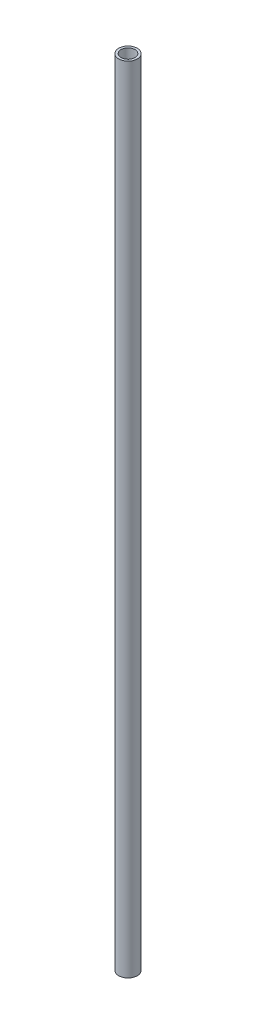
ISO-10303-21;
HEADER;
FILE_DESCRIPTION(('STEP AP214'),'2;1');
FILE_NAME('part.step','',(''),(''),'','','');
FILE_SCHEMA(('AUTOMOTIVE_DESIGN { 1 0 10303 214 1 1 1 1 }'));
ENDSEC;
DATA;
#1=APPLICATION_CONTEXT('core data for automotive mechanical design processes');
#2=APPLICATION_PROTOCOL_DEFINITION('international standard','automotive_design',2000,#1);
#3=PRODUCT_CONTEXT('',#1,'mechanical');
#4=PRODUCT('Part','Part','',(#3));
#5=PRODUCT_RELATED_PRODUCT_CATEGORY('part','',(#4));
#6=PRODUCT_DEFINITION_FORMATION('','',#4);
#7=PRODUCT_DEFINITION_CONTEXT('part definition',#1,'design');
#8=PRODUCT_DEFINITION('design','',#6,#7);
#9=PRODUCT_DEFINITION_SHAPE('','',#8);
#10=(LENGTH_UNIT() NAMED_UNIT(*) SI_UNIT(.MILLI.,.METRE.));
#11=(NAMED_UNIT(*) PLANE_ANGLE_UNIT() SI_UNIT($,.RADIAN.));
#12=(NAMED_UNIT(*) SI_UNIT($,.STERADIAN.) SOLID_ANGLE_UNIT());
#13=UNCERTAINTY_MEASURE_WITH_UNIT(LENGTH_MEASURE(1.E-05),#10,'distance_accuracy_value','');
#14=(GEOMETRIC_REPRESENTATION_CONTEXT(3) GLOBAL_UNCERTAINTY_ASSIGNED_CONTEXT((#13)) GLOBAL_UNIT_ASSIGNED_CONTEXT((#10,
#11,#12)) REPRESENTATION_CONTEXT('',''));
#15=CARTESIAN_POINT('',(0.,0.,0.));
#16=DIRECTION('',(0.,0.,1.));
#17=DIRECTION('',(1.,0.,0.));
#18=AXIS2_PLACEMENT_3D('',#15,#16,#17);
#19=CARTESIAN_POINT('',(0.,85.5,0.));
#20=DIRECTION('',(0.,1.,0.));
#21=DIRECTION('',(0.,0.,1.));
#22=AXIS2_PLACEMENT_3D('',#19,#20,#21);
#23=PLANE('',#22);
#24=CARTESIAN_POINT('',(0.,85.5,0.));
#25=DIRECTION('',(0.,1.,0.));
#26=DIRECTION('',(0.,0.,1.));
#27=AXIS2_PLACEMENT_3D('',#24,#25,#26);
#28=CIRCLE('',#27,2.);
#29=CARTESIAN_POINT('',(0.,85.5,2.));
#30=VERTEX_POINT('',#29);
#31=EDGE_CURVE('E10',#30,#30,#28,.T.);
#32=ORIENTED_EDGE('',*,*,#31,.T.);
#33=EDGE_LOOP('',(#32));
#34=FACE_BOUND('',#33,.T.);
#35=CARTESIAN_POINT('',(0.,85.5,0.));
#36=DIRECTION('',(0.,1.,0.));
#37=DIRECTION('',(0.,0.,1.));
#38=AXIS2_PLACEMENT_3D('',#35,#36,#37);
#39=CIRCLE('',#38,1.5);
#40=CARTESIAN_POINT('',(0.,85.5,1.5));
#41=VERTEX_POINT('',#40);
#42=EDGE_CURVE('E46',#41,#41,#39,.T.);
#43=ORIENTED_EDGE('',*,*,#42,.F.);
#44=EDGE_LOOP('',(#43));
#45=FACE_BOUND('',#44,.T.);
#46=ADVANCED_FACE('F35',(#34,#45),#23,.T.);
#47=CARTESIAN_POINT('',(0.,-85.5,0.));
#48=DIRECTION('',(0.,1.,0.));
#49=DIRECTION('',(0.,0.,1.));
#50=AXIS2_PLACEMENT_3D('',#47,#48,#49);
#51=PLANE('',#50);
#52=CARTESIAN_POINT('',(0.,-85.5,0.));
#53=DIRECTION('',(0.,1.,0.));
#54=DIRECTION('',(0.,0.,1.));
#55=AXIS2_PLACEMENT_3D('',#52,#53,#54);
#56=CIRCLE('',#55,2.);
#57=CARTESIAN_POINT('',(0.,-85.5,2.));
#58=VERTEX_POINT('',#57);
#59=EDGE_CURVE('E39',#58,#58,#56,.T.);
#60=ORIENTED_EDGE('',*,*,#59,.F.);
#61=EDGE_LOOP('',(#60));
#62=FACE_BOUND('',#61,.T.);
#63=CARTESIAN_POINT('',(0.,-85.5,0.));
#64=DIRECTION('',(0.,1.,0.));
#65=DIRECTION('',(0.,0.,1.));
#66=AXIS2_PLACEMENT_3D('',#63,#64,#65);
#67=CIRCLE('',#66,1.5);
#68=CARTESIAN_POINT('',(0.,-85.5,1.5));
#69=VERTEX_POINT('',#68);
#70=EDGE_CURVE('E48',#69,#69,#67,.T.);
#71=ORIENTED_EDGE('',*,*,#70,.T.);
#72=EDGE_LOOP('',(#71));
#73=FACE_BOUND('',#72,.T.);
#74=ADVANCED_FACE('F58',(#62,#73),#51,.F.);
#75=CARTESIAN_POINT('',(0.,85.5,0.));
#76=DIRECTION('',(0.,-1.,0.));
#77=DIRECTION('',(0.,0.,-1.));
#78=AXIS2_PLACEMENT_3D('',#75,#76,#77);
#79=CYLINDRICAL_SURFACE('',#78,2.);
#80=ORIENTED_EDGE('',*,*,#31,.F.);
#81=EDGE_LOOP('',(#80));
#82=FACE_BOUND('',#81,.T.);
#83=ORIENTED_EDGE('',*,*,#59,.T.);
#84=EDGE_LOOP('',(#83));
#85=FACE_BOUND('',#84,.T.);
#86=ADVANCED_FACE('F37',(#82,#85),#79,.T.);
#87=CARTESIAN_POINT('',(0.,85.5,0.));
#88=DIRECTION('',(0.,-1.,0.));
#89=DIRECTION('',(0.,0.,-1.));
#90=AXIS2_PLACEMENT_3D('',#87,#88,#89);
#91=CYLINDRICAL_SURFACE('',#90,1.5);
#92=ORIENTED_EDGE('',*,*,#42,.T.);
#93=EDGE_LOOP('',(#92));
#94=FACE_BOUND('',#93,.T.);
#95=ORIENTED_EDGE('',*,*,#70,.F.);
#96=EDGE_LOOP('',(#95));
#97=FACE_BOUND('',#96,.T.);
#98=ADVANCED_FACE('F54',(#94,#97),#91,.F.);
#99=CLOSED_SHELL('',(#46,#74,#86,#98));
#100=MANIFOLD_SOLID_BREP('B2',#99);
#101=ADVANCED_BREP_SHAPE_REPRESENTATION('',(#18,#100),#14);
#102=SHAPE_DEFINITION_REPRESENTATION(#9,#101);
ENDSEC;
END-ISO-10303-21;
